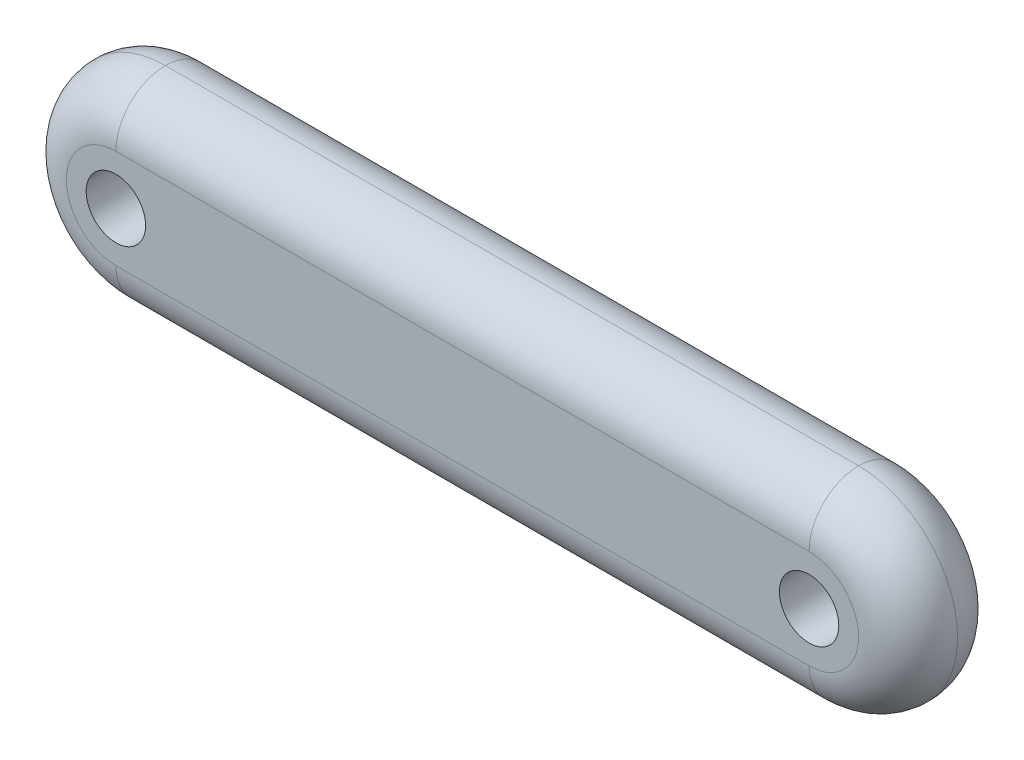
ISO-10303-21;
HEADER;
FILE_DESCRIPTION(('STEP AP214'),'2;1');
FILE_NAME('part.step','',(''),(''),'','','');
FILE_SCHEMA(('AUTOMOTIVE_DESIGN { 1 0 10303 214 1 1 1 1 }'));
ENDSEC;
DATA;
#1=APPLICATION_CONTEXT('core data for automotive mechanical design processes');
#2=APPLICATION_PROTOCOL_DEFINITION('international standard','automotive_design',2000,#1);
#3=PRODUCT_CONTEXT('',#1,'mechanical');
#4=PRODUCT('Part','Part','',(#3));
#5=PRODUCT_RELATED_PRODUCT_CATEGORY('part','',(#4));
#6=PRODUCT_DEFINITION_FORMATION('','',#4);
#7=PRODUCT_DEFINITION_CONTEXT('part definition',#1,'design');
#8=PRODUCT_DEFINITION('design','',#6,#7);
#9=PRODUCT_DEFINITION_SHAPE('','',#8);
#10=(LENGTH_UNIT() NAMED_UNIT(*) SI_UNIT(.MILLI.,.METRE.));
#11=(NAMED_UNIT(*) PLANE_ANGLE_UNIT() SI_UNIT($,.RADIAN.));
#12=(NAMED_UNIT(*) SI_UNIT($,.STERADIAN.) SOLID_ANGLE_UNIT());
#13=UNCERTAINTY_MEASURE_WITH_UNIT(LENGTH_MEASURE(1.E-05),#10,'distance_accuracy_value','');
#14=(GEOMETRIC_REPRESENTATION_CONTEXT(3) GLOBAL_UNCERTAINTY_ASSIGNED_CONTEXT((#13)) GLOBAL_UNIT_ASSIGNED_CONTEXT((#10,
#11,#12)) REPRESENTATION_CONTEXT('',''));
#15=CARTESIAN_POINT('',(0.,0.,0.));
#16=DIRECTION('',(0.,0.,1.));
#17=DIRECTION('',(1.,0.,0.));
#18=AXIS2_PLACEMENT_3D('',#15,#16,#17);
#19=CARTESIAN_POINT('',(-70.,0.,20.));
#20=DIRECTION('',(0.,0.,1.));
#21=DIRECTION('',(1.,0.,0.));
#22=AXIS2_PLACEMENT_3D('',#19,#20,#21);
#23=PLANE('',#22);
#24=DIRECTION('',(1.,0.,0.));
#25=VECTOR('',#24,1.);
#26=CARTESIAN_POINT('',(70.,-10.,20.));
#27=LINE('',#26,#25);
#28=CARTESIAN_POINT('',(-70.,-10.,20.));
#29=VERTEX_POINT('',#28);
#30=CARTESIAN_POINT('',(70.,-10.,20.));
#31=VERTEX_POINT('',#30);
#32=EDGE_CURVE('E114',#29,#31,#27,.T.);
#33=ORIENTED_EDGE('',*,*,#32,.T.);
#34=CARTESIAN_POINT('',(70.,0.,20.));
#35=DIRECTION('',(0.,0.,1.));
#36=DIRECTION('',(1.,0.,0.));
#37=AXIS2_PLACEMENT_3D('',#34,#35,#36);
#38=CIRCLE('',#37,10.);
#39=CARTESIAN_POINT('',(70.,10.,20.));
#40=VERTEX_POINT('',#39);
#41=EDGE_CURVE('E97',#31,#40,#38,.T.);
#42=ORIENTED_EDGE('',*,*,#41,.T.);
#43=DIRECTION('',(-1.,0.,0.));
#44=VECTOR('',#43,1.);
#45=CARTESIAN_POINT('',(-70.,10.,20.));
#46=LINE('',#45,#44);
#47=CARTESIAN_POINT('',(-70.,10.,20.));
#48=VERTEX_POINT('',#47);
#49=EDGE_CURVE('E104',#40,#48,#46,.T.);
#50=ORIENTED_EDGE('',*,*,#49,.T.);
#51=CARTESIAN_POINT('',(-70.,0.,20.));
#52=DIRECTION('',(0.,0.,1.));
#53=DIRECTION('',(1.,0.,0.));
#54=AXIS2_PLACEMENT_3D('',#51,#52,#53);
#55=CIRCLE('',#54,10.);
#56=EDGE_CURVE('E109',#48,#29,#55,.T.);
#57=ORIENTED_EDGE('',*,*,#56,.T.);
#58=EDGE_LOOP('',(#33,#42,#50,#57));
#59=FACE_BOUND('',#58,.T.);
#60=CARTESIAN_POINT('',(-70.,0.,20.));
#61=DIRECTION('',(0.,0.,1.));
#62=DIRECTION('',(1.,0.,0.));
#63=AXIS2_PLACEMENT_3D('',#60,#61,#62);
#64=CIRCLE('',#63,6.);
#65=CARTESIAN_POINT('',(-64.,0.,20.));
#66=VERTEX_POINT('',#65);
#67=EDGE_CURVE('E200',#66,#66,#64,.T.);
#68=ORIENTED_EDGE('',*,*,#67,.F.);
#69=EDGE_LOOP('',(#68));
#70=FACE_BOUND('',#69,.T.);
#71=CARTESIAN_POINT('',(70.,0.,20.));
#72=DIRECTION('',(0.,0.,1.));
#73=DIRECTION('',(1.,0.,0.));
#74=AXIS2_PLACEMENT_3D('',#71,#72,#73);
#75=CIRCLE('',#74,6.);
#76=CARTESIAN_POINT('',(76.,0.,20.));
#77=VERTEX_POINT('',#76);
#78=EDGE_CURVE('E136',#77,#77,#75,.T.);
#79=ORIENTED_EDGE('',*,*,#78,.F.);
#80=EDGE_LOOP('',(#79));
#81=FACE_BOUND('',#80,.T.);
#82=ADVANCED_FACE('F37',(#59,#70,#81),#23,.T.);
#83=CARTESIAN_POINT('',(-70.,0.,0.));
#84=DIRECTION('',(0.,0.,1.));
#85=DIRECTION('',(1.,0.,0.));
#86=AXIS2_PLACEMENT_3D('',#83,#84,#85);
#87=PLANE('',#86);
#88=DIRECTION('',(-1.,0.,0.));
#89=VECTOR('',#88,1.);
#90=CARTESIAN_POINT('',(-70.,10.,0.));
#91=LINE('',#90,#89);
#92=CARTESIAN_POINT('',(-70.,10.,0.));
#93=VERTEX_POINT('',#92);
#94=CARTESIAN_POINT('',(70.,10.,0.));
#95=VERTEX_POINT('',#94);
#96=EDGE_CURVE('E129',#93,#95,#91,.F.);
#97=ORIENTED_EDGE('',*,*,#96,.T.);
#98=CARTESIAN_POINT('',(70.,0.,0.));
#99=DIRECTION('',(0.,0.,1.));
#100=DIRECTION('',(1.,0.,0.));
#101=AXIS2_PLACEMENT_3D('',#98,#99,#100);
#102=CIRCLE('',#101,10.);
#103=CARTESIAN_POINT('',(70.,-10.,0.));
#104=VERTEX_POINT('',#103);
#105=EDGE_CURVE('E11',#95,#104,#102,.F.);
#106=ORIENTED_EDGE('',*,*,#105,.T.);
#107=DIRECTION('',(1.,0.,0.));
#108=VECTOR('',#107,1.);
#109=CARTESIAN_POINT('',(-70.,-10.,0.));
#110=LINE('',#109,#108);
#111=CARTESIAN_POINT('',(-70.,-10.,0.));
#112=VERTEX_POINT('',#111);
#113=EDGE_CURVE('E46',#104,#112,#110,.F.);
#114=ORIENTED_EDGE('',*,*,#113,.T.);
#115=CARTESIAN_POINT('',(-70.,0.,0.));
#116=DIRECTION('',(0.,0.,1.));
#117=DIRECTION('',(1.,0.,0.));
#118=AXIS2_PLACEMENT_3D('',#115,#116,#117);
#119=CIRCLE('',#118,10.);
#120=EDGE_CURVE('E138',#112,#93,#119,.F.);
#121=ORIENTED_EDGE('',*,*,#120,.T.);
#122=EDGE_LOOP('',(#97,#106,#114,#121));
#123=FACE_BOUND('',#122,.T.);
#124=ADVANCED_FACE('F154',(#123),#87,.F.);
#125=CARTESIAN_POINT('',(-70.,0.,20.));
#126=DIRECTION('',(0.,0.,-1.));
#127=DIRECTION('',(-1.,0.,0.));
#128=AXIS2_PLACEMENT_3D('',#125,#126,#127);
#129=CYLINDRICAL_SURFACE('',#128,6.);
#130=CARTESIAN_POINT('',(-70.,0.,2.99999999999999));
#131=DIRECTION('',(0.,0.,1.));
#132=DIRECTION('',(1.,0.,0.));
#133=AXIS2_PLACEMENT_3D('',#130,#131,#132);
#134=CIRCLE('',#133,6.);
#135=CARTESIAN_POINT('',(-64.,0.,2.99999999999999));
#136=VERTEX_POINT('',#135);
#137=EDGE_CURVE('E197',#136,#136,#134,.T.);
#138=ORIENTED_EDGE('',*,*,#137,.F.);
#139=EDGE_LOOP('',(#138));
#140=FACE_BOUND('',#139,.T.);
#141=ORIENTED_EDGE('',*,*,#67,.T.);
#142=EDGE_LOOP('',(#141));
#143=FACE_BOUND('',#142,.T.);
#144=ADVANCED_FACE('F170',(#140,#143),#129,.F.);
#145=CARTESIAN_POINT('',(70.,0.,20.));
#146=DIRECTION('',(0.,0.,-1.));
#147=DIRECTION('',(-1.,0.,0.));
#148=AXIS2_PLACEMENT_3D('',#145,#146,#147);
#149=CYLINDRICAL_SURFACE('',#148,6.);
#150=CARTESIAN_POINT('',(70.,0.,2.99999999999999));
#151=DIRECTION('',(0.,0.,1.));
#152=DIRECTION('',(1.,0.,0.));
#153=AXIS2_PLACEMENT_3D('',#150,#151,#152);
#154=CIRCLE('',#153,6.);
#155=CARTESIAN_POINT('',(76.,0.,2.99999999999999));
#156=VERTEX_POINT('',#155);
#157=EDGE_CURVE('E110',#156,#156,#154,.T.);
#158=ORIENTED_EDGE('',*,*,#157,.F.);
#159=EDGE_LOOP('',(#158));
#160=FACE_BOUND('',#159,.T.);
#161=ORIENTED_EDGE('',*,*,#78,.T.);
#162=EDGE_LOOP('',(#161));
#163=FACE_BOUND('',#162,.T.);
#164=ADVANCED_FACE('F206',(#160,#163),#149,.F.);
#165=CARTESIAN_POINT('',(-70.,0.,2.99999999999999));
#166=DIRECTION('',(0.,0.,1.));
#167=DIRECTION('',(1.,0.,0.));
#168=AXIS2_PLACEMENT_3D('',#165,#166,#167);
#169=PLANE('',#168);
#170=ORIENTED_EDGE('',*,*,#137,.T.);
#171=EDGE_LOOP('',(#170));
#172=FACE_BOUND('',#171,.T.);
#173=ADVANCED_FACE('F190',(#172),#169,.T.);
#174=CARTESIAN_POINT('',(70.,0.,2.99999999999999));
#175=DIRECTION('',(0.,0.,1.));
#176=DIRECTION('',(1.,0.,0.));
#177=AXIS2_PLACEMENT_3D('',#174,#175,#176);
#178=PLANE('',#177);
#179=ORIENTED_EDGE('',*,*,#157,.T.);
#180=EDGE_LOOP('',(#179));
#181=FACE_BOUND('',#180,.T.);
#182=ADVANCED_FACE('F185',(#181),#178,.T.);
#183=CARTESIAN_POINT('',(-70.,0.,10.));
#184=DIRECTION('',(0.,0.,1.));
#185=DIRECTION('',(1.,0.,0.));
#186=AXIS2_PLACEMENT_3D('',#183,#184,#185);
#187=DEGENERATE_TOROIDAL_SURFACE('',#186,10.,10.,.T.);
#188=CARTESIAN_POINT('',(-70.,10.,10.));
#189=DIRECTION('',(1.,0.,0.));
#190=DIRECTION('',(0.,0.,-1.));
#191=AXIS2_PLACEMENT_3D('',#188,#189,#190);
#192=CIRCLE('',#191,10.);
#193=CARTESIAN_POINT('',(-70.,20.,10.));
#194=VERTEX_POINT('',#193);
#195=EDGE_CURVE('E106',#194,#48,#192,.T.);
#196=ORIENTED_EDGE('',*,*,#195,.F.);
#197=CARTESIAN_POINT('',(-70.,0.,10.));
#198=DIRECTION('',(0.,0.,1.));
#199=DIRECTION('',(1.,0.,0.));
#200=AXIS2_PLACEMENT_3D('',#197,#198,#199);
#201=CIRCLE('',#200,20.);
#202=CARTESIAN_POINT('',(-70.,-20.,10.));
#203=VERTEX_POINT('',#202);
#204=EDGE_CURVE('E124',#203,#194,#201,.F.);
#205=ORIENTED_EDGE('',*,*,#204,.F.);
#206=CARTESIAN_POINT('',(-70.,-10.,10.));
#207=DIRECTION('',(1.,0.,0.));
#208=DIRECTION('',(0.,0.,-1.));
#209=AXIS2_PLACEMENT_3D('',#206,#207,#208);
#210=CIRCLE('',#209,10.);
#211=EDGE_CURVE('E133',#29,#203,#210,.T.);
#212=ORIENTED_EDGE('',*,*,#211,.F.);
#213=ORIENTED_EDGE('',*,*,#56,.F.);
#214=EDGE_LOOP('',(#196,#205,#212,#213));
#215=FACE_BOUND('',#214,.T.);
#216=ADVANCED_FACE('F182',(#215),#187,.T.);
#217=CARTESIAN_POINT('',(-70.,-10.,10.));
#218=DIRECTION('',(-1.,0.,0.));
#219=DIRECTION('',(0.,0.,1.));
#220=AXIS2_PLACEMENT_3D('',#217,#218,#219);
#221=CYLINDRICAL_SURFACE('',#220,10.);
#222=ORIENTED_EDGE('',*,*,#211,.T.);
#223=DIRECTION('',(1.,0.,0.));
#224=VECTOR('',#223,1.);
#225=CARTESIAN_POINT('',(-70.,-20.,10.));
#226=LINE('',#225,#224);
#227=CARTESIAN_POINT('',(70.,-20.,10.));
#228=VERTEX_POINT('',#227);
#229=EDGE_CURVE('E117',#228,#203,#226,.F.);
#230=ORIENTED_EDGE('',*,*,#229,.F.);
#231=CARTESIAN_POINT('',(70.,-10.,10.));
#232=DIRECTION('',(1.,0.,0.));
#233=DIRECTION('',(0.,0.,-1.));
#234=AXIS2_PLACEMENT_3D('',#231,#232,#233);
#235=CIRCLE('',#234,10.);
#236=EDGE_CURVE('E101',#31,#228,#235,.T.);
#237=ORIENTED_EDGE('',*,*,#236,.F.);
#238=ORIENTED_EDGE('',*,*,#32,.F.);
#239=EDGE_LOOP('',(#222,#230,#237,#238));
#240=FACE_BOUND('',#239,.T.);
#241=ADVANCED_FACE('F179',(#240),#221,.T.);
#242=CARTESIAN_POINT('',(-70.,10.,10.));
#243=DIRECTION('',(1.,0.,0.));
#244=DIRECTION('',(0.,0.,-1.));
#245=AXIS2_PLACEMENT_3D('',#242,#243,#244);
#246=CYLINDRICAL_SURFACE('',#245,10.);
#247=ORIENTED_EDGE('',*,*,#195,.T.);
#248=ORIENTED_EDGE('',*,*,#49,.F.);
#249=CARTESIAN_POINT('',(70.,10.,10.));
#250=DIRECTION('',(1.,0.,0.));
#251=DIRECTION('',(0.,0.,-1.));
#252=AXIS2_PLACEMENT_3D('',#249,#250,#251);
#253=CIRCLE('',#252,10.);
#254=CARTESIAN_POINT('',(70.,20.,10.));
#255=VERTEX_POINT('',#254);
#256=EDGE_CURVE('E93',#255,#40,#253,.T.);
#257=ORIENTED_EDGE('',*,*,#256,.F.);
#258=DIRECTION('',(-1.,0.,0.));
#259=VECTOR('',#258,1.);
#260=CARTESIAN_POINT('',(70.,20.,10.));
#261=LINE('',#260,#259);
#262=EDGE_CURVE('E127',#194,#255,#261,.F.);
#263=ORIENTED_EDGE('',*,*,#262,.F.);
#264=EDGE_LOOP('',(#247,#248,#257,#263));
#265=FACE_BOUND('',#264,.T.);
#266=ADVANCED_FACE('F105',(#265),#246,.T.);
#267=CARTESIAN_POINT('',(70.,0.,10.));
#268=DIRECTION('',(0.,0.,1.));
#269=DIRECTION('',(1.,0.,0.));
#270=AXIS2_PLACEMENT_3D('',#267,#268,#269);
#271=DEGENERATE_TOROIDAL_SURFACE('',#270,10.,10.,.T.);
#272=ORIENTED_EDGE('',*,*,#236,.T.);
#273=CARTESIAN_POINT('',(70.,0.,10.));
#274=DIRECTION('',(0.,0.,1.));
#275=DIRECTION('',(1.,0.,0.));
#276=AXIS2_PLACEMENT_3D('',#273,#274,#275);
#277=CIRCLE('',#276,20.);
#278=EDGE_CURVE('E98',#255,#228,#277,.F.);
#279=ORIENTED_EDGE('',*,*,#278,.F.);
#280=ORIENTED_EDGE('',*,*,#256,.T.);
#281=ORIENTED_EDGE('',*,*,#41,.F.);
#282=EDGE_LOOP('',(#272,#279,#280,#281));
#283=FACE_BOUND('',#282,.T.);
#284=ADVANCED_FACE('F95',(#283),#271,.T.);
#285=CARTESIAN_POINT('',(-70.,0.,10.));
#286=DIRECTION('',(0.,0.,1.));
#287=DIRECTION('',(1.,0.,0.));
#288=AXIS2_PLACEMENT_3D('',#285,#286,#287);
#289=DEGENERATE_TOROIDAL_SURFACE('',#288,10.,10.,.T.);
#290=CARTESIAN_POINT('',(-70.,10.,10.));
#291=DIRECTION('',(1.,0.,0.));
#292=DIRECTION('',(0.,0.,-1.));
#293=AXIS2_PLACEMENT_3D('',#290,#291,#292);
#294=CIRCLE('',#293,10.);
#295=EDGE_CURVE('E143',#93,#194,#294,.T.);
#296=ORIENTED_EDGE('',*,*,#295,.F.);
#297=ORIENTED_EDGE('',*,*,#120,.F.);
#298=CARTESIAN_POINT('',(-70.,-10.,10.));
#299=DIRECTION('',(1.,0.,0.));
#300=DIRECTION('',(0.,0.,-1.));
#301=AXIS2_PLACEMENT_3D('',#298,#299,#300);
#302=CIRCLE('',#301,10.);
#303=EDGE_CURVE('E41',#203,#112,#302,.T.);
#304=ORIENTED_EDGE('',*,*,#303,.F.);
#305=ORIENTED_EDGE('',*,*,#204,.T.);
#306=EDGE_LOOP('',(#296,#297,#304,#305));
#307=FACE_BOUND('',#306,.T.);
#308=ADVANCED_FACE('F39',(#307),#289,.T.);
#309=CARTESIAN_POINT('',(-70.,-10.,10.));
#310=DIRECTION('',(1.,0.,0.));
#311=DIRECTION('',(0.,0.,-1.));
#312=AXIS2_PLACEMENT_3D('',#309,#310,#311);
#313=CYLINDRICAL_SURFACE('',#312,10.);
#314=ORIENTED_EDGE('',*,*,#303,.T.);
#315=ORIENTED_EDGE('',*,*,#113,.F.);
#316=CARTESIAN_POINT('',(70.,-10.,10.));
#317=DIRECTION('',(1.,0.,0.));
#318=DIRECTION('',(0.,0.,-1.));
#319=AXIS2_PLACEMENT_3D('',#316,#317,#318);
#320=CIRCLE('',#319,10.);
#321=EDGE_CURVE('E54',#228,#104,#320,.T.);
#322=ORIENTED_EDGE('',*,*,#321,.F.);
#323=ORIENTED_EDGE('',*,*,#229,.T.);
#324=EDGE_LOOP('',(#314,#315,#322,#323));
#325=FACE_BOUND('',#324,.T.);
#326=ADVANCED_FACE('F151',(#325),#313,.T.);
#327=CARTESIAN_POINT('',(-70.,10.,10.));
#328=DIRECTION('',(-1.,0.,0.));
#329=DIRECTION('',(0.,0.,1.));
#330=AXIS2_PLACEMENT_3D('',#327,#328,#329);
#331=CYLINDRICAL_SURFACE('',#330,10.);
#332=ORIENTED_EDGE('',*,*,#295,.T.);
#333=ORIENTED_EDGE('',*,*,#262,.T.);
#334=CARTESIAN_POINT('',(70.,10.,10.));
#335=DIRECTION('',(1.,0.,0.));
#336=DIRECTION('',(0.,0.,-1.));
#337=AXIS2_PLACEMENT_3D('',#334,#335,#336);
#338=CIRCLE('',#337,10.);
#339=EDGE_CURVE('E141',#95,#255,#338,.T.);
#340=ORIENTED_EDGE('',*,*,#339,.F.);
#341=ORIENTED_EDGE('',*,*,#96,.F.);
#342=EDGE_LOOP('',(#332,#333,#340,#341));
#343=FACE_BOUND('',#342,.T.);
#344=ADVANCED_FACE('F157',(#343),#331,.T.);
#345=CARTESIAN_POINT('',(70.,0.,10.));
#346=DIRECTION('',(0.,0.,1.));
#347=DIRECTION('',(1.,0.,0.));
#348=AXIS2_PLACEMENT_3D('',#345,#346,#347);
#349=DEGENERATE_TOROIDAL_SURFACE('',#348,10.,10.,.T.);
#350=ORIENTED_EDGE('',*,*,#321,.T.);
#351=ORIENTED_EDGE('',*,*,#105,.F.);
#352=ORIENTED_EDGE('',*,*,#339,.T.);
#353=ORIENTED_EDGE('',*,*,#278,.T.);
#354=EDGE_LOOP('',(#350,#351,#352,#353));
#355=FACE_BOUND('',#354,.T.);
#356=ADVANCED_FACE('F156',(#355),#349,.T.);
#357=CLOSED_SHELL('',(#82,#124,#144,#164,#173,#182,#216,#241,#266,#284,#308,#326,#344,#356));
#358=MANIFOLD_SOLID_BREP('B2',#357);
#359=ADVANCED_BREP_SHAPE_REPRESENTATION('',(#18,#358),#14);
#360=SHAPE_DEFINITION_REPRESENTATION(#9,#359);
ENDSEC;
END-ISO-10303-21;
